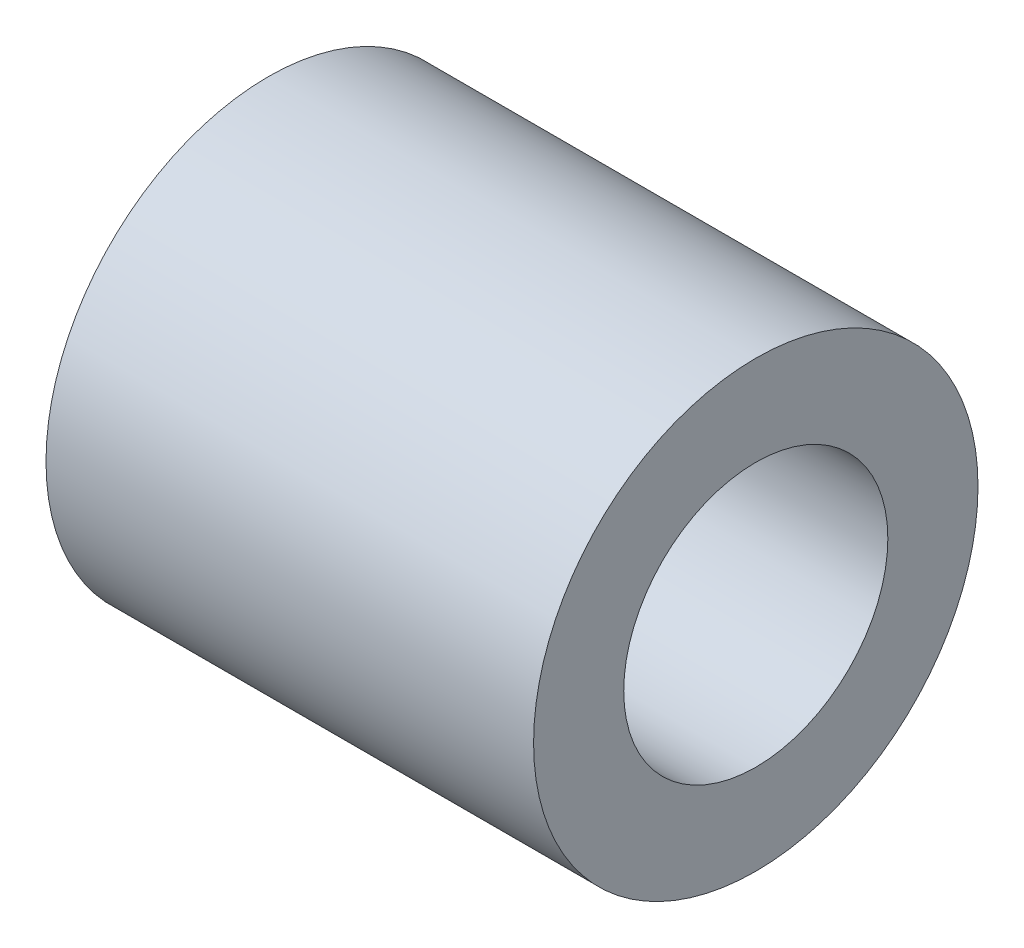
ISO-10303-21;
HEADER;
FILE_DESCRIPTION(('STEP AP214'),'2;1');
FILE_NAME('part.step','',(''),(''),'','','');
FILE_SCHEMA(('AUTOMOTIVE_DESIGN { 1 0 10303 214 1 1 1 1 }'));
ENDSEC;
DATA;
#1=APPLICATION_CONTEXT('core data for automotive mechanical design processes');
#2=APPLICATION_PROTOCOL_DEFINITION('international standard','automotive_design',2000,#1);
#3=PRODUCT_CONTEXT('',#1,'mechanical');
#4=PRODUCT('Part','Part','',(#3));
#5=PRODUCT_RELATED_PRODUCT_CATEGORY('part','',(#4));
#6=PRODUCT_DEFINITION_FORMATION('','',#4);
#7=PRODUCT_DEFINITION_CONTEXT('part definition',#1,'design');
#8=PRODUCT_DEFINITION('design','',#6,#7);
#9=PRODUCT_DEFINITION_SHAPE('','',#8);
#10=(LENGTH_UNIT() NAMED_UNIT(*) SI_UNIT(.MILLI.,.METRE.));
#11=(NAMED_UNIT(*) PLANE_ANGLE_UNIT() SI_UNIT($,.RADIAN.));
#12=(NAMED_UNIT(*) SI_UNIT($,.STERADIAN.) SOLID_ANGLE_UNIT());
#13=UNCERTAINTY_MEASURE_WITH_UNIT(LENGTH_MEASURE(1.E-05),#10,'distance_accuracy_value','');
#14=(GEOMETRIC_REPRESENTATION_CONTEXT(3) GLOBAL_UNCERTAINTY_ASSIGNED_CONTEXT((#13)) GLOBAL_UNIT_ASSIGNED_CONTEXT((#10,
#11,#12)) REPRESENTATION_CONTEXT('',''));
#15=CARTESIAN_POINT('',(0.,0.,0.));
#16=DIRECTION('',(0.,0.,1.));
#17=DIRECTION('',(1.,0.,0.));
#18=AXIS2_PLACEMENT_3D('',#15,#16,#17);
#19=CARTESIAN_POINT('',(12.192,0.,0.));
#20=DIRECTION('',(1.,0.,0.));
#21=DIRECTION('',(0.,0.,-1.));
#22=AXIS2_PLACEMENT_3D('',#19,#20,#21);
#23=PLANE('',#22);
#24=CARTESIAN_POINT('',(12.192,0.,0.));
#25=DIRECTION('',(1.,0.,0.));
#26=DIRECTION('',(0.,0.,-1.));
#27=AXIS2_PLACEMENT_3D('',#24,#25,#26);
#28=CIRCLE('',#27,5.55625);
#29=CARTESIAN_POINT('',(12.192,0.,-5.55625));
#30=VERTEX_POINT('',#29);
#31=EDGE_CURVE('E10',#30,#30,#28,.T.);
#32=ORIENTED_EDGE('',*,*,#31,.T.);
#33=EDGE_LOOP('',(#32));
#34=FACE_BOUND('',#33,.T.);
#35=CARTESIAN_POINT('',(12.192,0.,0.));
#36=DIRECTION('',(1.,0.,0.));
#37=DIRECTION('',(0.,0.,-1.));
#38=AXIS2_PLACEMENT_3D('',#35,#36,#37);
#39=CIRCLE('',#38,3.302);
#40=CARTESIAN_POINT('',(12.192,0.,-3.302));
#41=VERTEX_POINT('',#40);
#42=EDGE_CURVE('E42',#41,#41,#39,.T.);
#43=ORIENTED_EDGE('',*,*,#42,.F.);
#44=EDGE_LOOP('',(#43));
#45=FACE_BOUND('',#44,.T.);
#46=ADVANCED_FACE('F31',(#34,#45),#23,.T.);
#47=CARTESIAN_POINT('',(0.,0.,0.));
#48=DIRECTION('',(1.,0.,0.));
#49=DIRECTION('',(0.,0.,-1.));
#50=AXIS2_PLACEMENT_3D('',#47,#48,#49);
#51=PLANE('',#50);
#52=CARTESIAN_POINT('',(0.,0.,0.));
#53=DIRECTION('',(1.,0.,0.));
#54=DIRECTION('',(0.,0.,-1.));
#55=AXIS2_PLACEMENT_3D('',#52,#53,#54);
#56=CIRCLE('',#55,5.55625);
#57=CARTESIAN_POINT('',(0.,0.,-5.55625));
#58=VERTEX_POINT('',#57);
#59=EDGE_CURVE('E35',#58,#58,#56,.T.);
#60=ORIENTED_EDGE('',*,*,#59,.F.);
#61=EDGE_LOOP('',(#60));
#62=FACE_BOUND('',#61,.T.);
#63=CARTESIAN_POINT('',(0.,0.,0.));
#64=DIRECTION('',(1.,0.,0.));
#65=DIRECTION('',(0.,0.,-1.));
#66=AXIS2_PLACEMENT_3D('',#63,#64,#65);
#67=CIRCLE('',#66,3.302);
#68=CARTESIAN_POINT('',(0.,0.,-3.302));
#69=VERTEX_POINT('',#68);
#70=EDGE_CURVE('E44',#69,#69,#67,.T.);
#71=ORIENTED_EDGE('',*,*,#70,.T.);
#72=EDGE_LOOP('',(#71));
#73=FACE_BOUND('',#72,.T.);
#74=ADVANCED_FACE('F54',(#62,#73),#51,.F.);
#75=CARTESIAN_POINT('',(12.192,0.,0.));
#76=DIRECTION('',(-1.,0.,0.));
#77=DIRECTION('',(0.,0.,1.));
#78=AXIS2_PLACEMENT_3D('',#75,#76,#77);
#79=CYLINDRICAL_SURFACE('',#78,5.55625);
#80=ORIENTED_EDGE('',*,*,#31,.F.);
#81=EDGE_LOOP('',(#80));
#82=FACE_BOUND('',#81,.T.);
#83=ORIENTED_EDGE('',*,*,#59,.T.);
#84=EDGE_LOOP('',(#83));
#85=FACE_BOUND('',#84,.T.);
#86=ADVANCED_FACE('F33',(#82,#85),#79,.T.);
#87=CARTESIAN_POINT('',(12.192,0.,0.));
#88=DIRECTION('',(-1.,0.,0.));
#89=DIRECTION('',(0.,0.,1.));
#90=AXIS2_PLACEMENT_3D('',#87,#88,#89);
#91=CYLINDRICAL_SURFACE('',#90,3.302);
#92=ORIENTED_EDGE('',*,*,#42,.T.);
#93=EDGE_LOOP('',(#92));
#94=FACE_BOUND('',#93,.T.);
#95=ORIENTED_EDGE('',*,*,#70,.F.);
#96=EDGE_LOOP('',(#95));
#97=FACE_BOUND('',#96,.T.);
#98=ADVANCED_FACE('F50',(#94,#97),#91,.F.);
#99=CLOSED_SHELL('',(#46,#74,#86,#98));
#100=MANIFOLD_SOLID_BREP('B2',#99);
#101=ADVANCED_BREP_SHAPE_REPRESENTATION('',(#18,#100),#14);
#102=SHAPE_DEFINITION_REPRESENTATION(#9,#101);
ENDSEC;
END-ISO-10303-21;
